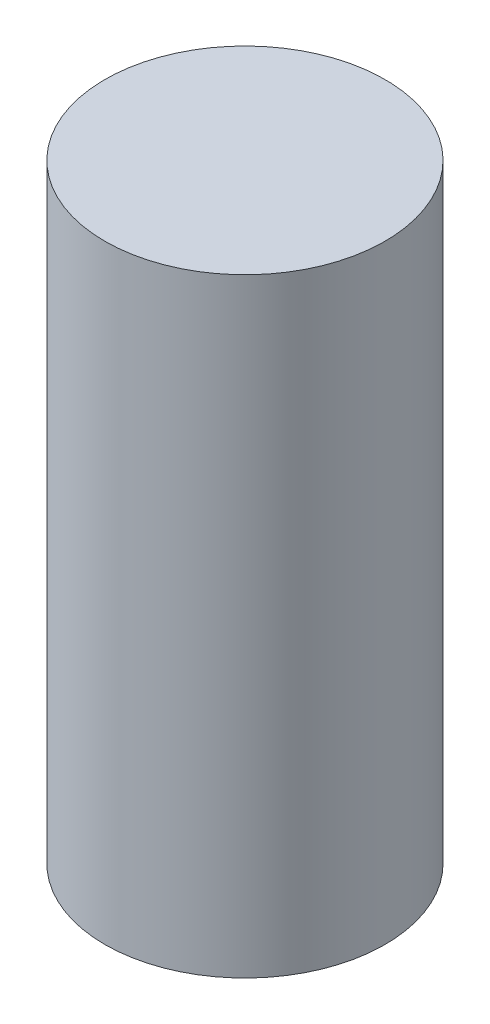
ISO-10303-21;
HEADER;
FILE_DESCRIPTION(('STEP AP214'),'2;1');
FILE_NAME('part.step','',(''),(''),'','','');
FILE_SCHEMA(('AUTOMOTIVE_DESIGN { 1 0 10303 214 1 1 1 1 }'));
ENDSEC;
DATA;
#1=APPLICATION_CONTEXT('core data for automotive mechanical design processes');
#2=APPLICATION_PROTOCOL_DEFINITION('international standard','automotive_design',2000,#1);
#3=PRODUCT_CONTEXT('',#1,'mechanical');
#4=PRODUCT('Part','Part','',(#3));
#5=PRODUCT_RELATED_PRODUCT_CATEGORY('part','',(#4));
#6=PRODUCT_DEFINITION_FORMATION('','',#4);
#7=PRODUCT_DEFINITION_CONTEXT('part definition',#1,'design');
#8=PRODUCT_DEFINITION('design','',#6,#7);
#9=PRODUCT_DEFINITION_SHAPE('','',#8);
#10=(LENGTH_UNIT() NAMED_UNIT(*) SI_UNIT(.MILLI.,.METRE.));
#11=(NAMED_UNIT(*) PLANE_ANGLE_UNIT() SI_UNIT($,.RADIAN.));
#12=(NAMED_UNIT(*) SI_UNIT($,.STERADIAN.) SOLID_ANGLE_UNIT());
#13=UNCERTAINTY_MEASURE_WITH_UNIT(LENGTH_MEASURE(1.E-05),#10,'distance_accuracy_value','');
#14=(GEOMETRIC_REPRESENTATION_CONTEXT(3) GLOBAL_UNCERTAINTY_ASSIGNED_CONTEXT((#13)) GLOBAL_UNIT_ASSIGNED_CONTEXT((#10,
#11,#12)) REPRESENTATION_CONTEXT('',''));
#15=CARTESIAN_POINT('',(0.,0.,0.));
#16=DIRECTION('',(0.,0.,1.));
#17=DIRECTION('',(1.,0.,0.));
#18=AXIS2_PLACEMENT_3D('',#15,#16,#17);
#19=CARTESIAN_POINT('',(0.,35.,0.));
#20=DIRECTION('',(0.,-1.,0.));
#21=DIRECTION('',(0.,0.,-1.));
#22=AXIS2_PLACEMENT_3D('',#19,#20,#21);
#23=CYLINDRICAL_SURFACE('',#22,8.05);
#24=CARTESIAN_POINT('',(0.,35.,0.));
#25=DIRECTION('',(0.,1.,0.));
#26=DIRECTION('',(0.,0.,1.));
#27=AXIS2_PLACEMENT_3D('',#24,#25,#26);
#28=CIRCLE('',#27,8.05);
#29=CARTESIAN_POINT('',(0.,35.,8.05));
#30=VERTEX_POINT('',#29);
#31=EDGE_CURVE('E10',#30,#30,#28,.T.);
#32=ORIENTED_EDGE('',*,*,#31,.F.);
#33=EDGE_LOOP('',(#32));
#34=FACE_BOUND('',#33,.T.);
#35=CARTESIAN_POINT('',(0.,0.,0.));
#36=DIRECTION('',(0.,1.,0.));
#37=DIRECTION('',(0.,0.,1.));
#38=AXIS2_PLACEMENT_3D('',#35,#36,#37);
#39=CIRCLE('',#38,8.05);
#40=CARTESIAN_POINT('',(0.,0.,8.05));
#41=VERTEX_POINT('',#40);
#42=EDGE_CURVE('E38',#41,#41,#39,.T.);
#43=ORIENTED_EDGE('',*,*,#42,.T.);
#44=EDGE_LOOP('',(#43));
#45=FACE_BOUND('',#44,.T.);
#46=ADVANCED_FACE('F35',(#34,#45),#23,.T.);
#47=CARTESIAN_POINT('',(0.,35.,0.));
#48=DIRECTION('',(0.,1.,0.));
#49=DIRECTION('',(0.,0.,1.));
#50=AXIS2_PLACEMENT_3D('',#47,#48,#49);
#51=PLANE('',#50);
#52=ORIENTED_EDGE('',*,*,#31,.T.);
#53=EDGE_LOOP('',(#52));
#54=FACE_BOUND('',#53,.T.);
#55=ADVANCED_FACE('F50',(#54),#51,.T.);
#56=CARTESIAN_POINT('',(0.,0.,0.));
#57=DIRECTION('',(0.,1.,0.));
#58=DIRECTION('',(0.,0.,1.));
#59=AXIS2_PLACEMENT_3D('',#56,#57,#58);
#60=PLANE('',#59);
#61=ORIENTED_EDGE('',*,*,#42,.F.);
#62=EDGE_LOOP('',(#61));
#63=FACE_BOUND('',#62,.T.);
#64=ADVANCED_FACE('F48',(#63),#60,.F.);
#65=CLOSED_SHELL('',(#46,#55,#64));
#66=MANIFOLD_SOLID_BREP('B2',#65);
#67=ADVANCED_BREP_SHAPE_REPRESENTATION('',(#18,#66),#14);
#68=SHAPE_DEFINITION_REPRESENTATION(#9,#67);
ENDSEC;
END-ISO-10303-21;
